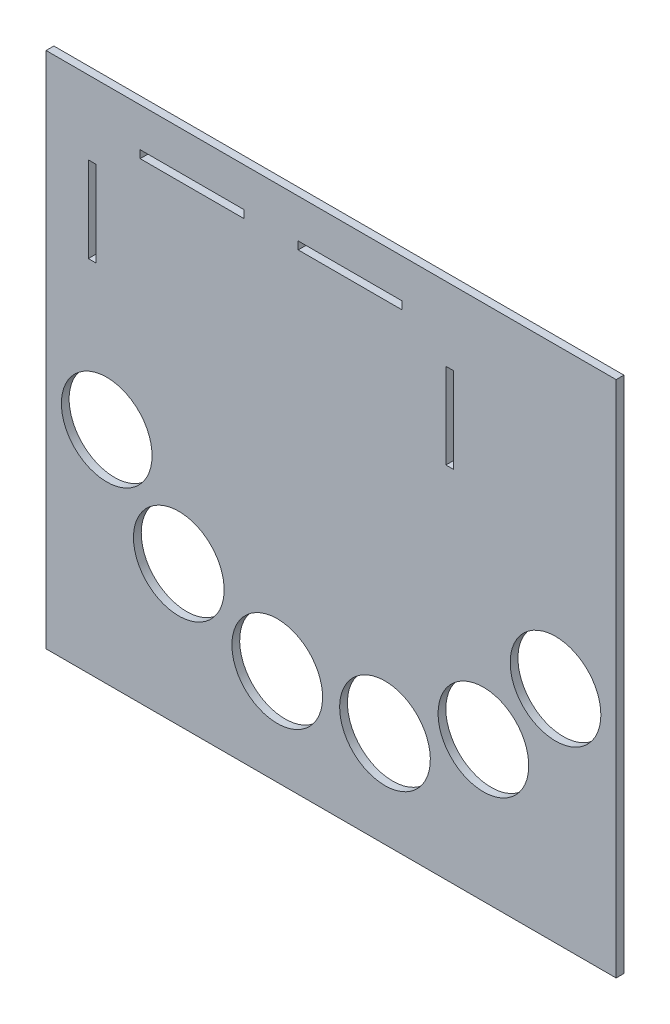
ISO-10303-21;
HEADER;
FILE_DESCRIPTION(('STEP AP214'),'2;1');
FILE_NAME('part.step','',(''),(''),'','','');
FILE_SCHEMA(('AUTOMOTIVE_DESIGN { 1 0 10303 214 1 1 1 1 }'));
ENDSEC;
DATA;
#1=APPLICATION_CONTEXT('core data for automotive mechanical design processes');
#2=APPLICATION_PROTOCOL_DEFINITION('international standard','automotive_design',2000,#1);
#3=PRODUCT_CONTEXT('',#1,'mechanical');
#4=PRODUCT('Part','Part','',(#3));
#5=PRODUCT_RELATED_PRODUCT_CATEGORY('part','',(#4));
#6=PRODUCT_DEFINITION_FORMATION('','',#4);
#7=PRODUCT_DEFINITION_CONTEXT('part definition',#1,'design');
#8=PRODUCT_DEFINITION('design','',#6,#7);
#9=PRODUCT_DEFINITION_SHAPE('','',#8);
#10=(LENGTH_UNIT() NAMED_UNIT(*) SI_UNIT(.MILLI.,.METRE.));
#11=(NAMED_UNIT(*) PLANE_ANGLE_UNIT() SI_UNIT($,.RADIAN.));
#12=(NAMED_UNIT(*) SI_UNIT($,.STERADIAN.) SOLID_ANGLE_UNIT());
#13=UNCERTAINTY_MEASURE_WITH_UNIT(LENGTH_MEASURE(1.E-05),#10,'distance_accuracy_value','');
#14=(GEOMETRIC_REPRESENTATION_CONTEXT(3) GLOBAL_UNCERTAINTY_ASSIGNED_CONTEXT((#13)) GLOBAL_UNIT_ASSIGNED_CONTEXT((#10,
#11,#12)) REPRESENTATION_CONTEXT('',''));
#15=CARTESIAN_POINT('',(0.,0.,0.));
#16=DIRECTION('',(0.,0.,1.));
#17=DIRECTION('',(1.,0.,0.));
#18=AXIS2_PLACEMENT_3D('',#15,#16,#17);
#19=CARTESIAN_POINT('',(0.,0.,0.));
#20=DIRECTION('',(0.,0.,-1.));
#21=DIRECTION('',(-1.,0.,0.));
#22=AXIS2_PLACEMENT_3D('',#19,#20,#21);
#23=PLANE('',#22);
#24=CARTESIAN_POINT('',(-58.7785252292477,-45.9016994374945,0.));
#25=DIRECTION('',(0.,0.,1.));
#26=DIRECTION('',(0.913545457642601,0.406736643075801,0.));
#27=AXIS2_PLACEMENT_3D('',#24,#25,#26);
#28=CIRCLE('',#27,17.5);
#29=CARTESIAN_POINT('',(-42.7914797205022,-38.7838081836679,0.));
#30=VERTEX_POINT('',#29);
#31=EDGE_CURVE('E309',#30,#30,#28,.T.);
#32=ORIENTED_EDGE('',*,*,#31,.T.);
#33=EDGE_LOOP('',(#32));
#34=FACE_BOUND('',#33,.T.);
#35=CARTESIAN_POINT('',(-20.7911690817763,-62.8147600733805,0.));
#36=DIRECTION('',(0.,0.,1.));
#37=DIRECTION('',(0.669130606358857,0.743144825477395,0.));
#38=AXIS2_PLACEMENT_3D('',#35,#36,#37);
#39=CIRCLE('',#38,17.5);
#40=CARTESIAN_POINT('',(-9.08138347049632,-49.8097256275261,0.));
#41=VERTEX_POINT('',#40);
#42=EDGE_CURVE('E316',#41,#41,#39,.T.);
#43=ORIENTED_EDGE('',*,*,#42,.T.);
#44=EDGE_LOOP('',(#43));
#45=FACE_BOUND('',#44,.T.);
#46=CARTESIAN_POINT('',(20.7911690817756,-62.8147600733806,0.));
#47=DIRECTION('',(0.,0.,1.));
#48=DIRECTION('',(0.309016994374945,0.951056516295154,0.));
#49=AXIS2_PLACEMENT_3D('',#46,#47,#48);
#50=CIRCLE('',#49,17.5);
#51=CARTESIAN_POINT('',(26.1989664833372,-46.1712710382154,0.));
#52=VERTEX_POINT('',#51);
#53=EDGE_CURVE('E322',#52,#52,#50,.T.);
#54=ORIENTED_EDGE('',*,*,#53,.T.);
#55=EDGE_LOOP('',(#54));
#56=FACE_BOUND('',#55,.T.);
#57=CARTESIAN_POINT('',(86.6025403784438,-15.0000000000001,0.));
#58=DIRECTION('',(0.,0.,1.));
#59=DIRECTION('',(-0.500000000000004,0.866025403784436,0.));
#60=AXIS2_PLACEMENT_3D('',#57,#58,#59);
#61=CIRCLE('',#60,17.5);
#62=CARTESIAN_POINT('',(77.8525403784437,0.155444566227538,0.));
#63=VERTEX_POINT('',#62);
#64=EDGE_CURVE('E329',#63,#63,#61,.T.);
#65=ORIENTED_EDGE('',*,*,#64,.T.);
#66=EDGE_LOOP('',(#65));
#67=FACE_BOUND('',#66,.T.);
#68=CARTESIAN_POINT('',(58.7785252292471,-45.9016994374949,0.));
#69=DIRECTION('',(0.,0.,1.));
#70=DIRECTION('',(-0.104528463267657,0.994521895368273,0.));
#71=AXIS2_PLACEMENT_3D('',#68,#69,#70);
#72=CIRCLE('',#71,17.5);
#73=CARTESIAN_POINT('',(56.9492771220631,-28.4975662685501,0.));
#74=VERTEX_POINT('',#73);
#75=EDGE_CURVE('E328',#74,#74,#72,.T.);
#76=ORIENTED_EDGE('',*,*,#75,.T.);
#77=EDGE_LOOP('',(#76));
#78=FACE_BOUND('',#77,.T.);
#79=CARTESIAN_POINT('',(-86.6025403784442,-14.9999999999995,0.));
#80=DIRECTION('',(0.,0.,1.));
#81=DIRECTION('',(1.,0.,0.));
#82=AXIS2_PLACEMENT_3D('',#79,#80,#81);
#83=CIRCLE('',#82,17.5);
#84=CARTESIAN_POINT('',(-69.1025403784441,-14.9999999999995,0.));
#85=VERTEX_POINT('',#84);
#86=EDGE_CURVE('E339',#85,#85,#83,.T.);
#87=ORIENTED_EDGE('',*,*,#86,.T.);
#88=EDGE_LOOP('',(#87));
#89=FACE_BOUND('',#88,.T.);
#90=DIRECTION('',(0.,1.,0.));
#91=VECTOR('',#90,1.);
#92=CARTESIAN_POINT('',(110.,-100.,0.));
#93=LINE('',#92,#91);
#94=CARTESIAN_POINT('',(110.,-100.,0.));
#95=VERTEX_POINT('',#94);
#96=CARTESIAN_POINT('',(110.,100.,0.));
#97=VERTEX_POINT('',#96);
#98=EDGE_CURVE('E342',#95,#97,#93,.T.);
#99=ORIENTED_EDGE('',*,*,#98,.F.);
#100=DIRECTION('',(1.,0.,0.));
#101=VECTOR('',#100,1.);
#102=CARTESIAN_POINT('',(-110.,-100.,0.));
#103=LINE('',#102,#101);
#104=CARTESIAN_POINT('',(-110.,-100.,0.));
#105=VERTEX_POINT('',#104);
#106=EDGE_CURVE('E349',#105,#95,#103,.T.);
#107=ORIENTED_EDGE('',*,*,#106,.F.);
#108=DIRECTION('',(0.,-1.,0.));
#109=VECTOR('',#108,1.);
#110=CARTESIAN_POINT('',(-110.,-100.,0.));
#111=LINE('',#110,#109);
#112=CARTESIAN_POINT('',(-110.,100.,0.));
#113=VERTEX_POINT('',#112);
#114=EDGE_CURVE('E360',#113,#105,#111,.T.);
#115=ORIENTED_EDGE('',*,*,#114,.F.);
#116=DIRECTION('',(-1.,0.,0.));
#117=VECTOR('',#116,1.);
#118=CARTESIAN_POINT('',(-110.,100.,0.));
#119=LINE('',#118,#117);
#120=EDGE_CURVE('E358',#97,#113,#119,.T.);
#121=ORIENTED_EDGE('',*,*,#120,.F.);
#122=EDGE_LOOP('',(#99,#107,#115,#121));
#123=FACE_BOUND('',#122,.T.);
#124=DIRECTION('',(0.,-1.,0.));
#125=VECTOR('',#124,1.);
#126=CARTESIAN_POINT('',(-90.7,38.6,0.));
#127=LINE('',#126,#125);
#128=CARTESIAN_POINT('',(-90.7,71.6,0.));
#129=VERTEX_POINT('',#128);
#130=CARTESIAN_POINT('',(-90.7,38.6,0.));
#131=VERTEX_POINT('',#130);
#132=EDGE_CURVE('E197',#129,#131,#127,.T.);
#133=ORIENTED_EDGE('',*,*,#132,.F.);
#134=DIRECTION('',(1.,0.,0.));
#135=VECTOR('',#134,1.);
#136=CARTESIAN_POINT('',(-93.7,71.6,0.));
#137=LINE('',#136,#135);
#138=CARTESIAN_POINT('',(-93.7,71.6,0.));
#139=VERTEX_POINT('',#138);
#140=EDGE_CURVE('E179',#139,#129,#137,.T.);
#141=ORIENTED_EDGE('',*,*,#140,.F.);
#142=DIRECTION('',(0.,1.,0.));
#143=VECTOR('',#142,1.);
#144=CARTESIAN_POINT('',(-93.7,38.6,0.));
#145=LINE('',#144,#143);
#146=CARTESIAN_POINT('',(-93.7,38.6,0.));
#147=VERTEX_POINT('',#146);
#148=EDGE_CURVE('E189',#147,#139,#145,.T.);
#149=ORIENTED_EDGE('',*,*,#148,.F.);
#150=DIRECTION('',(-1.,0.,0.));
#151=VECTOR('',#150,1.);
#152=CARTESIAN_POINT('',(-93.7,38.6,0.));
#153=LINE('',#152,#151);
#154=EDGE_CURVE('E194',#131,#147,#153,.T.);
#155=ORIENTED_EDGE('',*,*,#154,.F.);
#156=EDGE_LOOP('',(#133,#141,#149,#155));
#157=FACE_BOUND('',#156,.T.);
#158=DIRECTION('',(1.,0.,0.));
#159=VECTOR('',#158,1.);
#160=CARTESIAN_POINT('',(-12.6999999999732,85.0000000000037,0.));
#161=LINE('',#160,#159);
#162=CARTESIAN_POINT('',(-12.6999999999732,85.0000000000037,0.));
#163=VERTEX_POINT('',#162);
#164=CARTESIAN_POINT('',(27.3000000000268,85.0000000000037,0.));
#165=VERTEX_POINT('',#164);
#166=EDGE_CURVE('E224',#163,#165,#161,.T.);
#167=ORIENTED_EDGE('',*,*,#166,.F.);
#168=DIRECTION('',(0.,1.,0.));
#169=VECTOR('',#168,1.);
#170=CARTESIAN_POINT('',(-12.6999999999732,82.0000000000037,0.));
#171=LINE('',#170,#169);
#172=CARTESIAN_POINT('',(-12.6999999999732,82.0000000000037,0.));
#173=VERTEX_POINT('',#172);
#174=EDGE_CURVE('E226',#173,#163,#171,.T.);
#175=ORIENTED_EDGE('',*,*,#174,.F.);
#176=DIRECTION('',(-1.,0.,0.));
#177=VECTOR('',#176,1.);
#178=CARTESIAN_POINT('',(-12.6999999999732,82.0000000000037,0.));
#179=LINE('',#178,#177);
#180=CARTESIAN_POINT('',(27.3000000000268,82.0000000000037,0.));
#181=VERTEX_POINT('',#180);
#182=EDGE_CURVE('E229',#181,#173,#179,.T.);
#183=ORIENTED_EDGE('',*,*,#182,.F.);
#184=DIRECTION('',(0.,-1.,0.));
#185=VECTOR('',#184,1.);
#186=CARTESIAN_POINT('',(27.3000000000268,82.0000000000037,0.));
#187=LINE('',#186,#185);
#188=EDGE_CURVE('E220',#165,#181,#187,.T.);
#189=ORIENTED_EDGE('',*,*,#188,.F.);
#190=EDGE_LOOP('',(#167,#175,#183,#189));
#191=FACE_BOUND('',#190,.T.);
#192=DIRECTION('',(1.,0.,0.));
#193=VECTOR('',#192,1.);
#194=CARTESIAN_POINT('',(-73.6999999999732,85.0000000000037,0.));
#195=LINE('',#194,#193);
#196=CARTESIAN_POINT('',(-73.6999999999732,85.0000000000037,0.));
#197=VERTEX_POINT('',#196);
#198=CARTESIAN_POINT('',(-33.6999999999732,85.0000000000037,0.));
#199=VERTEX_POINT('',#198);
#200=EDGE_CURVE('E249',#197,#199,#195,.T.);
#201=ORIENTED_EDGE('',*,*,#200,.F.);
#202=DIRECTION('',(0.,1.,0.));
#203=VECTOR('',#202,1.);
#204=CARTESIAN_POINT('',(-73.6999999999732,82.0000000000037,0.));
#205=LINE('',#204,#203);
#206=CARTESIAN_POINT('',(-73.6999999999732,82.0000000000037,0.));
#207=VERTEX_POINT('',#206);
#208=EDGE_CURVE('E251',#207,#197,#205,.T.);
#209=ORIENTED_EDGE('',*,*,#208,.F.);
#210=DIRECTION('',(-1.,0.,0.));
#211=VECTOR('',#210,1.);
#212=CARTESIAN_POINT('',(-73.6999999999732,82.0000000000037,0.));
#213=LINE('',#212,#211);
#214=CARTESIAN_POINT('',(-33.6999999999732,82.0000000000037,0.));
#215=VERTEX_POINT('',#214);
#216=EDGE_CURVE('E254',#215,#207,#213,.T.);
#217=ORIENTED_EDGE('',*,*,#216,.F.);
#218=DIRECTION('',(0.,-1.,0.));
#219=VECTOR('',#218,1.);
#220=CARTESIAN_POINT('',(-33.6999999999732,82.0000000000037,0.));
#221=LINE('',#220,#219);
#222=EDGE_CURVE('E247',#199,#215,#221,.T.);
#223=ORIENTED_EDGE('',*,*,#222,.F.);
#224=EDGE_LOOP('',(#201,#209,#217,#223));
#225=FACE_BOUND('',#224,.T.);
#226=DIRECTION('',(0.,-1.,0.));
#227=VECTOR('',#226,1.);
#228=CARTESIAN_POINT('',(47.3,38.6,0.));
#229=LINE('',#228,#227);
#230=CARTESIAN_POINT('',(47.3,71.6,0.));
#231=VERTEX_POINT('',#230);
#232=CARTESIAN_POINT('',(47.3,38.6,0.));
#233=VERTEX_POINT('',#232);
#234=EDGE_CURVE('E274',#231,#233,#229,.T.);
#235=ORIENTED_EDGE('',*,*,#234,.F.);
#236=DIRECTION('',(1.,0.,0.));
#237=VECTOR('',#236,1.);
#238=CARTESIAN_POINT('',(44.3,71.6,0.));
#239=LINE('',#238,#237);
#240=CARTESIAN_POINT('',(44.3,71.6,0.));
#241=VERTEX_POINT('',#240);
#242=EDGE_CURVE('E277',#241,#231,#239,.T.);
#243=ORIENTED_EDGE('',*,*,#242,.F.);
#244=DIRECTION('',(0.,1.,0.));
#245=VECTOR('',#244,1.);
#246=CARTESIAN_POINT('',(44.3,38.6,0.));
#247=LINE('',#246,#245);
#248=CARTESIAN_POINT('',(44.3,38.6,0.));
#249=VERTEX_POINT('',#248);
#250=EDGE_CURVE('E280',#249,#241,#247,.T.);
#251=ORIENTED_EDGE('',*,*,#250,.F.);
#252=DIRECTION('',(-1.,0.,0.));
#253=VECTOR('',#252,1.);
#254=CARTESIAN_POINT('',(44.3,38.6,0.));
#255=LINE('',#254,#253);
#256=EDGE_CURVE('E267',#233,#249,#255,.T.);
#257=ORIENTED_EDGE('',*,*,#256,.F.);
#258=EDGE_LOOP('',(#235,#243,#251,#257));
#259=FACE_BOUND('',#258,.T.);
#260=ADVANCED_FACE('F37',(#34,#45,#56,#67,#78,#89,#123,#157,#191,#225,#259),#23,.T.);
#261=CARTESIAN_POINT('',(110.,-100.,3.));
#262=DIRECTION('',(-1.,0.,0.));
#263=DIRECTION('',(0.,0.,1.));
#264=AXIS2_PLACEMENT_3D('',#261,#262,#263);
#265=PLANE('',#264);
#266=ORIENTED_EDGE('',*,*,#98,.T.);
#267=DIRECTION('',(0.,0.,-1.));
#268=VECTOR('',#267,1.);
#269=CARTESIAN_POINT('',(110.,100.,3.));
#270=LINE('',#269,#268);
#271=CARTESIAN_POINT('',(110.,100.,3.));
#272=VERTEX_POINT('',#271);
#273=EDGE_CURVE('E11',#272,#97,#270,.T.);
#274=ORIENTED_EDGE('',*,*,#273,.F.);
#275=DIRECTION('',(0.,1.,0.));
#276=VECTOR('',#275,1.);
#277=CARTESIAN_POINT('',(110.,-100.,3.));
#278=LINE('',#277,#276);
#279=CARTESIAN_POINT('',(110.,-100.,3.));
#280=VERTEX_POINT('',#279);
#281=EDGE_CURVE('E345',#280,#272,#278,.T.);
#282=ORIENTED_EDGE('',*,*,#281,.F.);
#283=DIRECTION('',(0.,0.,-1.));
#284=VECTOR('',#283,1.);
#285=CARTESIAN_POINT('',(110.,-100.,3.));
#286=LINE('',#285,#284);
#287=EDGE_CURVE('E355',#280,#95,#286,.T.);
#288=ORIENTED_EDGE('',*,*,#287,.T.);
#289=EDGE_LOOP('',(#266,#274,#282,#288));
#290=FACE_BOUND('',#289,.T.);
#291=ADVANCED_FACE('F39',(#290),#265,.F.);
#292=CARTESIAN_POINT('',(-110.,100.,3.));
#293=DIRECTION('',(0.,-1.,0.));
#294=DIRECTION('',(0.,0.,-1.));
#295=AXIS2_PLACEMENT_3D('',#292,#293,#294);
#296=PLANE('',#295);
#297=ORIENTED_EDGE('',*,*,#120,.T.);
#298=DIRECTION('',(0.,0.,-1.));
#299=VECTOR('',#298,1.);
#300=CARTESIAN_POINT('',(-110.,100.,3.));
#301=LINE('',#300,#299);
#302=CARTESIAN_POINT('',(-110.,100.,3.));
#303=VERTEX_POINT('',#302);
#304=EDGE_CURVE('E45',#303,#113,#301,.T.);
#305=ORIENTED_EDGE('',*,*,#304,.F.);
#306=DIRECTION('',(-1.,0.,0.));
#307=VECTOR('',#306,1.);
#308=CARTESIAN_POINT('',(-110.,100.,3.));
#309=LINE('',#308,#307);
#310=EDGE_CURVE('E348',#272,#303,#309,.T.);
#311=ORIENTED_EDGE('',*,*,#310,.F.);
#312=ORIENTED_EDGE('',*,*,#273,.T.);
#313=EDGE_LOOP('',(#297,#305,#311,#312));
#314=FACE_BOUND('',#313,.T.);
#315=ADVANCED_FACE('F387',(#314),#296,.F.);
#316=CARTESIAN_POINT('',(-110.,-100.,3.));
#317=DIRECTION('',(1.,0.,0.));
#318=DIRECTION('',(0.,0.,-1.));
#319=AXIS2_PLACEMENT_3D('',#316,#317,#318);
#320=PLANE('',#319);
#321=ORIENTED_EDGE('',*,*,#114,.T.);
#322=DIRECTION('',(0.,0.,-1.));
#323=VECTOR('',#322,1.);
#324=CARTESIAN_POINT('',(-110.,-100.,3.));
#325=LINE('',#324,#323);
#326=CARTESIAN_POINT('',(-110.,-100.,3.));
#327=VERTEX_POINT('',#326);
#328=EDGE_CURVE('E365',#327,#105,#325,.T.);
#329=ORIENTED_EDGE('',*,*,#328,.F.);
#330=DIRECTION('',(0.,-1.,0.));
#331=VECTOR('',#330,1.);
#332=CARTESIAN_POINT('',(-110.,-100.,3.));
#333=LINE('',#332,#331);
#334=EDGE_CURVE('E351',#303,#327,#333,.T.);
#335=ORIENTED_EDGE('',*,*,#334,.F.);
#336=ORIENTED_EDGE('',*,*,#304,.T.);
#337=EDGE_LOOP('',(#321,#329,#335,#336));
#338=FACE_BOUND('',#337,.T.);
#339=ADVANCED_FACE('F372',(#338),#320,.F.);
#340=CARTESIAN_POINT('',(-110.,-100.,3.));
#341=DIRECTION('',(0.,1.,0.));
#342=DIRECTION('',(0.,0.,1.));
#343=AXIS2_PLACEMENT_3D('',#340,#341,#342);
#344=PLANE('',#343);
#345=ORIENTED_EDGE('',*,*,#106,.T.);
#346=ORIENTED_EDGE('',*,*,#287,.F.);
#347=DIRECTION('',(1.,0.,0.));
#348=VECTOR('',#347,1.);
#349=CARTESIAN_POINT('',(-110.,-100.,3.));
#350=LINE('',#349,#348);
#351=EDGE_CURVE('E353',#327,#280,#350,.T.);
#352=ORIENTED_EDGE('',*,*,#351,.F.);
#353=ORIENTED_EDGE('',*,*,#328,.T.);
#354=EDGE_LOOP('',(#345,#346,#352,#353));
#355=FACE_BOUND('',#354,.T.);
#356=ADVANCED_FACE('F380',(#355),#344,.F.);
#357=CARTESIAN_POINT('',(0.,0.,3.));
#358=DIRECTION('',(0.,0.,-1.));
#359=DIRECTION('',(-1.,0.,0.));
#360=AXIS2_PLACEMENT_3D('',#357,#358,#359);
#361=PLANE('',#360);
#362=DIRECTION('',(-1.,0.,0.));
#363=VECTOR('',#362,1.);
#364=CARTESIAN_POINT('',(44.3,38.6,3.));
#365=LINE('',#364,#363);
#366=CARTESIAN_POINT('',(47.3,38.6,3.));
#367=VERTEX_POINT('',#366);
#368=CARTESIAN_POINT('',(44.3,38.6,3.));
#369=VERTEX_POINT('',#368);
#370=EDGE_CURVE('E264',#367,#369,#365,.T.);
#371=ORIENTED_EDGE('',*,*,#370,.T.);
#372=DIRECTION('',(0.,1.,0.));
#373=VECTOR('',#372,1.);
#374=CARTESIAN_POINT('',(44.3,0.,3.));
#375=LINE('',#374,#373);
#376=CARTESIAN_POINT('',(44.3,71.6,3.));
#377=VERTEX_POINT('',#376);
#378=EDGE_CURVE('E305',#369,#377,#375,.T.);
#379=ORIENTED_EDGE('',*,*,#378,.T.);
#380=DIRECTION('',(1.,0.,0.));
#381=VECTOR('',#380,1.);
#382=CARTESIAN_POINT('',(44.3,71.6,3.));
#383=LINE('',#382,#381);
#384=CARTESIAN_POINT('',(47.3,71.6,3.));
#385=VERTEX_POINT('',#384);
#386=EDGE_CURVE('E269',#377,#385,#383,.T.);
#387=ORIENTED_EDGE('',*,*,#386,.T.);
#388=DIRECTION('',(0.,1.,0.));
#389=VECTOR('',#388,1.);
#390=CARTESIAN_POINT('',(47.3,0.,3.));
#391=LINE('',#390,#389);
#392=EDGE_CURVE('E303',#367,#385,#391,.T.);
#393=ORIENTED_EDGE('',*,*,#392,.F.);
#394=EDGE_LOOP('',(#371,#379,#387,#393));
#395=FACE_BOUND('',#394,.T.);
#396=DIRECTION('',(0.,1.,0.));
#397=VECTOR('',#396,1.);
#398=CARTESIAN_POINT('',(-73.6999999999732,82.0000000000037,3.00000000000797));
#399=LINE('',#398,#397);
#400=CARTESIAN_POINT('',(-73.6999999999732,82.0000000000037,3.00000000000797));
#401=VERTEX_POINT('',#400);
#402=CARTESIAN_POINT('',(-73.6999999999732,85.0000000000037,3.00000000000797));
#403=VERTEX_POINT('',#402);
#404=EDGE_CURVE('E243',#401,#403,#399,.T.);
#405=ORIENTED_EDGE('',*,*,#404,.T.);
#406=DIRECTION('',(1.,0.,0.));
#407=VECTOR('',#406,1.);
#408=CARTESIAN_POINT('',(0.,85.0000000000037,3.));
#409=LINE('',#408,#407);
#410=CARTESIAN_POINT('',(-33.6999999999732,85.0000000000037,3.00000000000797));
#411=VERTEX_POINT('',#410);
#412=EDGE_CURVE('E302',#403,#411,#409,.T.);
#413=ORIENTED_EDGE('',*,*,#412,.T.);
#414=DIRECTION('',(0.,-1.,0.));
#415=VECTOR('',#414,1.);
#416=CARTESIAN_POINT('',(-33.6999999999732,82.0000000000037,3.00000000000797));
#417=LINE('',#416,#415);
#418=CARTESIAN_POINT('',(-33.6999999999732,82.0000000000037,3.));
#419=VERTEX_POINT('',#418);
#420=EDGE_CURVE('E239',#411,#419,#417,.T.);
#421=ORIENTED_EDGE('',*,*,#420,.T.);
#422=DIRECTION('',(1.,0.,0.));
#423=VECTOR('',#422,1.);
#424=CARTESIAN_POINT('',(0.,82.0000000000037,3.));
#425=LINE('',#424,#423);
#426=EDGE_CURVE('E298',#401,#419,#425,.T.);
#427=ORIENTED_EDGE('',*,*,#426,.F.);
#428=EDGE_LOOP('',(#405,#413,#421,#427));
#429=FACE_BOUND('',#428,.T.);
#430=DIRECTION('',(0.,1.,0.));
#431=VECTOR('',#430,1.);
#432=CARTESIAN_POINT('',(-12.6999999999732,82.0000000000037,3.00000000000797));
#433=LINE('',#432,#431);
#434=CARTESIAN_POINT('',(-12.6999999999732,82.0000000000037,3.00000000000797));
#435=VERTEX_POINT('',#434);
#436=CARTESIAN_POINT('',(-12.6999999999732,85.0000000000037,3.00000000000797));
#437=VERTEX_POINT('',#436);
#438=EDGE_CURVE('E216',#435,#437,#433,.T.);
#439=ORIENTED_EDGE('',*,*,#438,.T.);
#440=CARTESIAN_POINT('',(27.3000000000268,85.0000000000037,3.00000000000797));
#441=VERTEX_POINT('',#440);
#442=EDGE_CURVE('E299',#437,#441,#409,.T.);
#443=ORIENTED_EDGE('',*,*,#442,.T.);
#444=DIRECTION('',(0.,-1.,0.));
#445=VECTOR('',#444,1.);
#446=CARTESIAN_POINT('',(27.3000000000268,82.0000000000037,3.00000000000797));
#447=LINE('',#446,#445);
#448=CARTESIAN_POINT('',(27.3000000000268,82.0000000000037,3.));
#449=VERTEX_POINT('',#448);
#450=EDGE_CURVE('E211',#441,#449,#447,.T.);
#451=ORIENTED_EDGE('',*,*,#450,.T.);
#452=EDGE_CURVE('E295',#435,#449,#425,.T.);
#453=ORIENTED_EDGE('',*,*,#452,.F.);
#454=EDGE_LOOP('',(#439,#443,#451,#453));
#455=FACE_BOUND('',#454,.T.);
#456=DIRECTION('',(0.,-1.,0.));
#457=VECTOR('',#456,1.);
#458=CARTESIAN_POINT('',(-93.6999999999732,0.,3.));
#459=LINE('',#458,#457);
#460=CARTESIAN_POINT('',(-93.7,71.6,3.));
#461=VERTEX_POINT('',#460);
#462=CARTESIAN_POINT('',(-93.7,38.6,3.));
#463=VERTEX_POINT('',#462);
#464=EDGE_CURVE('E293',#461,#463,#459,.T.);
#465=ORIENTED_EDGE('',*,*,#464,.F.);
#466=DIRECTION('',(1.,0.,0.));
#467=VECTOR('',#466,1.);
#468=CARTESIAN_POINT('',(-93.7,71.6,3.));
#469=LINE('',#468,#467);
#470=CARTESIAN_POINT('',(-90.7,71.6,3.));
#471=VERTEX_POINT('',#470);
#472=EDGE_CURVE('E182',#461,#471,#469,.T.);
#473=ORIENTED_EDGE('',*,*,#472,.T.);
#474=DIRECTION('',(0.,-1.,0.));
#475=VECTOR('',#474,1.);
#476=CARTESIAN_POINT('',(-90.7,0.,3.));
#477=LINE('',#476,#475);
#478=CARTESIAN_POINT('',(-90.7,38.6,3.));
#479=VERTEX_POINT('',#478);
#480=EDGE_CURVE('E276',#471,#479,#477,.T.);
#481=ORIENTED_EDGE('',*,*,#480,.T.);
#482=DIRECTION('',(-1.,0.,0.));
#483=VECTOR('',#482,1.);
#484=CARTESIAN_POINT('',(-93.7,38.6,3.));
#485=LINE('',#484,#483);
#486=EDGE_CURVE('E203',#479,#463,#485,.T.);
#487=ORIENTED_EDGE('',*,*,#486,.T.);
#488=EDGE_LOOP('',(#465,#473,#481,#487));
#489=FACE_BOUND('',#488,.T.);
#490=CARTESIAN_POINT('',(-58.7785252292477,-45.9016994374945,3.));
#491=DIRECTION('',(0.,0.,1.));
#492=DIRECTION('',(0.913545457642601,0.406736643075801,0.));
#493=AXIS2_PLACEMENT_3D('',#490,#491,#492);
#494=CIRCLE('',#493,17.5);
#495=CARTESIAN_POINT('',(-42.7914797205022,-38.7838081836679,3.));
#496=VERTEX_POINT('',#495);
#497=EDGE_CURVE('E313',#496,#496,#494,.T.);
#498=ORIENTED_EDGE('',*,*,#497,.F.);
#499=EDGE_LOOP('',(#498));
#500=FACE_BOUND('',#499,.T.);
#501=CARTESIAN_POINT('',(-20.7911690817763,-62.8147600733805,3.));
#502=DIRECTION('',(0.,0.,1.));
#503=DIRECTION('',(0.669130606358857,0.743144825477395,0.));
#504=AXIS2_PLACEMENT_3D('',#501,#502,#503);
#505=CIRCLE('',#504,17.5);
#506=CARTESIAN_POINT('',(-9.08138347049632,-49.8097256275261,3.));
#507=VERTEX_POINT('',#506);
#508=EDGE_CURVE('E319',#507,#507,#505,.T.);
#509=ORIENTED_EDGE('',*,*,#508,.F.);
#510=EDGE_LOOP('',(#509));
#511=FACE_BOUND('',#510,.T.);
#512=CARTESIAN_POINT('',(20.7911690817756,-62.8147600733806,3.));
#513=DIRECTION('',(0.,0.,1.));
#514=DIRECTION('',(0.309016994374945,0.951056516295154,0.));
#515=AXIS2_PLACEMENT_3D('',#512,#513,#514);
#516=CIRCLE('',#515,17.5);
#517=CARTESIAN_POINT('',(26.1989664833372,-46.1712710382154,3.));
#518=VERTEX_POINT('',#517);
#519=EDGE_CURVE('E325',#518,#518,#516,.T.);
#520=ORIENTED_EDGE('',*,*,#519,.F.);
#521=EDGE_LOOP('',(#520));
#522=FACE_BOUND('',#521,.T.);
#523=CARTESIAN_POINT('',(86.6025403784438,-15.0000000000001,3.));
#524=DIRECTION('',(0.,0.,1.));
#525=DIRECTION('',(-0.500000000000004,0.866025403784436,0.));
#526=AXIS2_PLACEMENT_3D('',#523,#524,#525);
#527=CIRCLE('',#526,17.5);
#528=CARTESIAN_POINT('',(77.8525403784437,0.155444566227538,3.));
#529=VERTEX_POINT('',#528);
#530=EDGE_CURVE('E308',#529,#529,#527,.T.);
#531=ORIENTED_EDGE('',*,*,#530,.F.);
#532=EDGE_LOOP('',(#531));
#533=FACE_BOUND('',#532,.T.);
#534=CARTESIAN_POINT('',(58.7785252292471,-45.9016994374949,3.));
#535=DIRECTION('',(0.,0.,1.));
#536=DIRECTION('',(-0.104528463267657,0.994521895368273,0.));
#537=AXIS2_PLACEMENT_3D('',#534,#535,#536);
#538=CIRCLE('',#537,17.5);
#539=CARTESIAN_POINT('',(56.9492771220631,-28.4975662685501,3.));
#540=VERTEX_POINT('',#539);
#541=EDGE_CURVE('E332',#540,#540,#538,.T.);
#542=ORIENTED_EDGE('',*,*,#541,.F.);
#543=EDGE_LOOP('',(#542));
#544=FACE_BOUND('',#543,.T.);
#545=CARTESIAN_POINT('',(-86.6025403784442,-14.9999999999995,3.));
#546=DIRECTION('',(0.,0.,1.));
#547=DIRECTION('',(1.,0.,0.));
#548=AXIS2_PLACEMENT_3D('',#545,#546,#547);
#549=CIRCLE('',#548,17.5);
#550=CARTESIAN_POINT('',(-69.1025403784441,-14.9999999999995,3.));
#551=VERTEX_POINT('',#550);
#552=EDGE_CURVE('E312',#551,#551,#549,.T.);
#553=ORIENTED_EDGE('',*,*,#552,.F.);
#554=EDGE_LOOP('',(#553));
#555=FACE_BOUND('',#554,.T.);
#556=ORIENTED_EDGE('',*,*,#281,.T.);
#557=ORIENTED_EDGE('',*,*,#310,.T.);
#558=ORIENTED_EDGE('',*,*,#334,.T.);
#559=ORIENTED_EDGE('',*,*,#351,.T.);
#560=EDGE_LOOP('',(#556,#557,#558,#559));
#561=FACE_BOUND('',#560,.T.);
#562=ADVANCED_FACE('F386',(#395,#429,#455,#489,#500,#511,#522,#533,#544,#555,#561),#361,.F.);
#563=CARTESIAN_POINT('',(-86.6025403784442,-14.9999999999995,0.));
#564=DIRECTION('',(0.,0.,1.));
#565=DIRECTION('',(1.,0.,0.));
#566=AXIS2_PLACEMENT_3D('',#563,#564,#565);
#567=CYLINDRICAL_SURFACE('',#566,17.5);
#568=ORIENTED_EDGE('',*,*,#86,.F.);
#569=EDGE_LOOP('',(#568));
#570=FACE_BOUND('',#569,.T.);
#571=ORIENTED_EDGE('',*,*,#552,.T.);
#572=EDGE_LOOP('',(#571));
#573=FACE_BOUND('',#572,.T.);
#574=ADVANCED_FACE('F407',(#570,#573),#567,.F.);
#575=CARTESIAN_POINT('',(58.7785252292471,-45.9016994374949,0.));
#576=DIRECTION('',(0.,0.,1.));
#577=DIRECTION('',(1.,0.,0.));
#578=AXIS2_PLACEMENT_3D('',#575,#576,#577);
#579=CYLINDRICAL_SURFACE('',#578,17.5);
#580=ORIENTED_EDGE('',*,*,#75,.F.);
#581=EDGE_LOOP('',(#580));
#582=FACE_BOUND('',#581,.T.);
#583=ORIENTED_EDGE('',*,*,#541,.T.);
#584=EDGE_LOOP('',(#583));
#585=FACE_BOUND('',#584,.T.);
#586=ADVANCED_FACE('F412',(#582,#585),#579,.F.);
#587=CARTESIAN_POINT('',(86.6025403784438,-15.0000000000001,0.));
#588=DIRECTION('',(0.,0.,1.));
#589=DIRECTION('',(1.,0.,0.));
#590=AXIS2_PLACEMENT_3D('',#587,#588,#589);
#591=CYLINDRICAL_SURFACE('',#590,17.5);
#592=ORIENTED_EDGE('',*,*,#64,.F.);
#593=EDGE_LOOP('',(#592));
#594=FACE_BOUND('',#593,.T.);
#595=ORIENTED_EDGE('',*,*,#530,.T.);
#596=EDGE_LOOP('',(#595));
#597=FACE_BOUND('',#596,.T.);
#598=ADVANCED_FACE('F437',(#594,#597),#591,.F.);
#599=CARTESIAN_POINT('',(20.7911690817756,-62.8147600733806,0.));
#600=DIRECTION('',(0.,0.,1.));
#601=DIRECTION('',(1.,0.,0.));
#602=AXIS2_PLACEMENT_3D('',#599,#600,#601);
#603=CYLINDRICAL_SURFACE('',#602,17.5);
#604=ORIENTED_EDGE('',*,*,#53,.F.);
#605=EDGE_LOOP('',(#604));
#606=FACE_BOUND('',#605,.T.);
#607=ORIENTED_EDGE('',*,*,#519,.T.);
#608=EDGE_LOOP('',(#607));
#609=FACE_BOUND('',#608,.T.);
#610=ADVANCED_FACE('F443',(#606,#609),#603,.F.);
#611=CARTESIAN_POINT('',(-20.7911690817763,-62.8147600733805,0.));
#612=DIRECTION('',(0.,0.,1.));
#613=DIRECTION('',(1.,0.,0.));
#614=AXIS2_PLACEMENT_3D('',#611,#612,#613);
#615=CYLINDRICAL_SURFACE('',#614,17.5);
#616=ORIENTED_EDGE('',*,*,#42,.F.);
#617=EDGE_LOOP('',(#616));
#618=FACE_BOUND('',#617,.T.);
#619=ORIENTED_EDGE('',*,*,#508,.T.);
#620=EDGE_LOOP('',(#619));
#621=FACE_BOUND('',#620,.T.);
#622=ADVANCED_FACE('F450',(#618,#621),#615,.F.);
#623=CARTESIAN_POINT('',(-58.7785252292477,-45.9016994374945,0.));
#624=DIRECTION('',(0.,0.,1.));
#625=DIRECTION('',(1.,0.,0.));
#626=AXIS2_PLACEMENT_3D('',#623,#624,#625);
#627=CYLINDRICAL_SURFACE('',#626,17.5);
#628=ORIENTED_EDGE('',*,*,#31,.F.);
#629=EDGE_LOOP('',(#628));
#630=FACE_BOUND('',#629,.T.);
#631=ORIENTED_EDGE('',*,*,#497,.T.);
#632=EDGE_LOOP('',(#631));
#633=FACE_BOUND('',#632,.T.);
#634=ADVANCED_FACE('F454',(#630,#633),#627,.F.);
#635=CARTESIAN_POINT('',(-93.7,38.6,-33.1360830515618));
#636=DIRECTION('',(0.,1.,0.));
#637=DIRECTION('',(-1.,0.,0.));
#638=AXIS2_PLACEMENT_3D('',#635,#636,#637);
#639=PLANE('',#638);
#640=ORIENTED_EDGE('',*,*,#154,.T.);
#641=DIRECTION('',(0.,0.,1.));
#642=VECTOR('',#641,1.);
#643=CARTESIAN_POINT('',(-93.7,38.6,-33.1360830515618));
#644=LINE('',#643,#642);
#645=EDGE_CURVE('E186',#147,#463,#644,.T.);
#646=ORIENTED_EDGE('',*,*,#645,.T.);
#647=ORIENTED_EDGE('',*,*,#486,.F.);
#648=DIRECTION('',(0.,0.,1.));
#649=VECTOR('',#648,1.);
#650=CARTESIAN_POINT('',(-90.7,38.6,-33.1360830515618));
#651=LINE('',#650,#649);
#652=EDGE_CURVE('E207',#131,#479,#651,.T.);
#653=ORIENTED_EDGE('',*,*,#652,.F.);
#654=EDGE_LOOP('',(#640,#646,#647,#653));
#655=FACE_BOUND('',#654,.T.);
#656=ADVANCED_FACE('F458',(#655),#639,.T.);
#657=CARTESIAN_POINT('',(-93.7,71.6,-33.1360830515618));
#658=DIRECTION('',(0.,-1.,0.));
#659=DIRECTION('',(1.,0.,0.));
#660=AXIS2_PLACEMENT_3D('',#657,#658,#659);
#661=PLANE('',#660);
#662=ORIENTED_EDGE('',*,*,#140,.T.);
#663=DIRECTION('',(0.,0.,1.));
#664=VECTOR('',#663,1.);
#665=CARTESIAN_POINT('',(-90.7,71.6,-33.1360830515618));
#666=LINE('',#665,#664);
#667=EDGE_CURVE('E205',#129,#471,#666,.T.);
#668=ORIENTED_EDGE('',*,*,#667,.T.);
#669=ORIENTED_EDGE('',*,*,#472,.F.);
#670=DIRECTION('',(0.,0.,1.));
#671=VECTOR('',#670,1.);
#672=CARTESIAN_POINT('',(-93.7,71.6,-33.1360830515618));
#673=LINE('',#672,#671);
#674=EDGE_CURVE('E174',#139,#461,#673,.T.);
#675=ORIENTED_EDGE('',*,*,#674,.F.);
#676=EDGE_LOOP('',(#662,#668,#669,#675));
#677=FACE_BOUND('',#676,.T.);
#678=ADVANCED_FACE('F176',(#677),#661,.T.);
#679=CARTESIAN_POINT('',(-90.7,100.135528326875,176.5));
#680=DIRECTION('',(1.,0.,0.));
#681=DIRECTION('',(0.,0.,-1.));
#682=AXIS2_PLACEMENT_3D('',#679,#680,#681);
#683=PLANE('',#682);
#684=ORIENTED_EDGE('',*,*,#667,.F.);
#685=ORIENTED_EDGE('',*,*,#132,.T.);
#686=ORIENTED_EDGE('',*,*,#652,.T.);
#687=ORIENTED_EDGE('',*,*,#480,.F.);
#688=EDGE_LOOP('',(#684,#685,#686,#687));
#689=FACE_BOUND('',#688,.T.);
#690=ADVANCED_FACE('F484',(#689),#683,.F.);
#691=CARTESIAN_POINT('',(-93.6999999999732,85.0000000000037,176.500000000008));
#692=DIRECTION('',(1.,0.,0.));
#693=DIRECTION('',(0.,0.,-1.));
#694=AXIS2_PLACEMENT_3D('',#691,#692,#693);
#695=PLANE('',#694);
#696=ORIENTED_EDGE('',*,*,#464,.T.);
#697=ORIENTED_EDGE('',*,*,#645,.F.);
#698=ORIENTED_EDGE('',*,*,#148,.T.);
#699=ORIENTED_EDGE('',*,*,#674,.T.);
#700=EDGE_LOOP('',(#696,#697,#698,#699));
#701=FACE_BOUND('',#700,.T.);
#702=ADVANCED_FACE('F190',(#701),#695,.T.);
#703=CARTESIAN_POINT('',(27.3000000000268,82.0000000000037,-40.1123422402632));
#704=DIRECTION('',(-1.,0.,0.));
#705=DIRECTION('',(0.,-1.,0.));
#706=AXIS2_PLACEMENT_3D('',#703,#704,#705);
#707=PLANE('',#706);
#708=ORIENTED_EDGE('',*,*,#188,.T.);
#709=DIRECTION('',(0.,0.,1.));
#710=VECTOR('',#709,1.);
#711=CARTESIAN_POINT('',(27.3000000000268,82.0000000000037,-40.1123422402632));
#712=LINE('',#711,#710);
#713=EDGE_CURVE('E214',#181,#449,#712,.T.);
#714=ORIENTED_EDGE('',*,*,#713,.T.);
#715=ORIENTED_EDGE('',*,*,#450,.F.);
#716=DIRECTION('',(0.,0.,1.));
#717=VECTOR('',#716,1.);
#718=CARTESIAN_POINT('',(27.3000000000268,85.0000000000037,-40.1123422402632));
#719=LINE('',#718,#717);
#720=EDGE_CURVE('E215',#165,#441,#719,.T.);
#721=ORIENTED_EDGE('',*,*,#720,.F.);
#722=EDGE_LOOP('',(#708,#714,#715,#721));
#723=FACE_BOUND('',#722,.T.);
#724=ADVANCED_FACE('F483',(#723),#707,.T.);
#725=CARTESIAN_POINT('',(-12.6999999999732,82.0000000000037,-40.1123422402632));
#726=DIRECTION('',(1.,0.,0.));
#727=DIRECTION('',(0.,1.,0.));
#728=AXIS2_PLACEMENT_3D('',#725,#726,#727);
#729=PLANE('',#728);
#730=ORIENTED_EDGE('',*,*,#174,.T.);
#731=DIRECTION('',(0.,0.,1.));
#732=VECTOR('',#731,1.);
#733=CARTESIAN_POINT('',(-12.6999999999732,85.0000000000037,-40.1123422402632));
#734=LINE('',#733,#732);
#735=EDGE_CURVE('E219',#163,#437,#734,.T.);
#736=ORIENTED_EDGE('',*,*,#735,.T.);
#737=ORIENTED_EDGE('',*,*,#438,.F.);
#738=DIRECTION('',(0.,0.,1.));
#739=VECTOR('',#738,1.);
#740=CARTESIAN_POINT('',(-12.6999999999732,82.0000000000037,-40.1123422402632));
#741=LINE('',#740,#739);
#742=EDGE_CURVE('E199',#173,#435,#741,.T.);
#743=ORIENTED_EDGE('',*,*,#742,.F.);
#744=EDGE_LOOP('',(#730,#736,#737,#743));
#745=FACE_BOUND('',#744,.T.);
#746=ADVANCED_FACE('F496',(#745),#729,.T.);
#747=CARTESIAN_POINT('',(-64.2625925660206,82.0000000000037,176.500000000008));
#748=DIRECTION('',(0.,1.,0.));
#749=DIRECTION('',(-1.,0.,0.));
#750=AXIS2_PLACEMENT_3D('',#747,#748,#749);
#751=PLANE('',#750);
#752=ORIENTED_EDGE('',*,*,#452,.T.);
#753=ORIENTED_EDGE('',*,*,#713,.F.);
#754=ORIENTED_EDGE('',*,*,#182,.T.);
#755=ORIENTED_EDGE('',*,*,#742,.T.);
#756=EDGE_LOOP('',(#752,#753,#754,#755));
#757=FACE_BOUND('',#756,.T.);
#758=ADVANCED_FACE('F489',(#757),#751,.T.);
#759=CARTESIAN_POINT('',(-64.2625925660206,85.0000000000037,176.500000000008));
#760=DIRECTION('',(0.,1.,0.));
#761=DIRECTION('',(-1.,0.,0.));
#762=AXIS2_PLACEMENT_3D('',#759,#760,#761);
#763=PLANE('',#762);
#764=ORIENTED_EDGE('',*,*,#735,.F.);
#765=ORIENTED_EDGE('',*,*,#166,.T.);
#766=ORIENTED_EDGE('',*,*,#720,.T.);
#767=ORIENTED_EDGE('',*,*,#442,.F.);
#768=EDGE_LOOP('',(#764,#765,#766,#767));
#769=FACE_BOUND('',#768,.T.);
#770=ADVANCED_FACE('F474',(#769),#763,.F.);
#771=CARTESIAN_POINT('',(-33.6999999999732,82.0000000000037,-40.1123422402632));
#772=DIRECTION('',(-1.,0.,0.));
#773=DIRECTION('',(0.,-1.,0.));
#774=AXIS2_PLACEMENT_3D('',#771,#772,#773);
#775=PLANE('',#774);
#776=ORIENTED_EDGE('',*,*,#222,.T.);
#777=DIRECTION('',(0.,0.,1.));
#778=VECTOR('',#777,1.);
#779=CARTESIAN_POINT('',(-33.6999999999732,82.0000000000037,-40.1123422402632));
#780=LINE('',#779,#778);
#781=EDGE_CURVE('E60',#215,#419,#780,.T.);
#782=ORIENTED_EDGE('',*,*,#781,.T.);
#783=ORIENTED_EDGE('',*,*,#420,.F.);
#784=DIRECTION('',(0.,0.,1.));
#785=VECTOR('',#784,1.);
#786=CARTESIAN_POINT('',(-33.6999999999732,85.0000000000037,-40.1123422402632));
#787=LINE('',#786,#785);
#788=EDGE_CURVE('E242',#199,#411,#787,.T.);
#789=ORIENTED_EDGE('',*,*,#788,.F.);
#790=EDGE_LOOP('',(#776,#782,#783,#789));
#791=FACE_BOUND('',#790,.T.);
#792=ADVANCED_FACE('F492',(#791),#775,.T.);
#793=CARTESIAN_POINT('',(-73.6999999999732,82.0000000000037,-40.1123422402632));
#794=DIRECTION('',(1.,0.,0.));
#795=DIRECTION('',(0.,1.,0.));
#796=AXIS2_PLACEMENT_3D('',#793,#794,#795);
#797=PLANE('',#796);
#798=ORIENTED_EDGE('',*,*,#208,.T.);
#799=DIRECTION('',(0.,0.,1.));
#800=VECTOR('',#799,1.);
#801=CARTESIAN_POINT('',(-73.6999999999732,85.0000000000037,-40.1123422402632));
#802=LINE('',#801,#800);
#803=EDGE_CURVE('E246',#197,#403,#802,.T.);
#804=ORIENTED_EDGE('',*,*,#803,.T.);
#805=ORIENTED_EDGE('',*,*,#404,.F.);
#806=DIRECTION('',(0.,0.,1.));
#807=VECTOR('',#806,1.);
#808=CARTESIAN_POINT('',(-73.6999999999732,82.0000000000037,-40.1123422402632));
#809=LINE('',#808,#807);
#810=EDGE_CURVE('E223',#207,#401,#809,.T.);
#811=ORIENTED_EDGE('',*,*,#810,.F.);
#812=EDGE_LOOP('',(#798,#804,#805,#811));
#813=FACE_BOUND('',#812,.T.);
#814=ADVANCED_FACE('F487',(#813),#797,.T.);
#815=ORIENTED_EDGE('',*,*,#426,.T.);
#816=ORIENTED_EDGE('',*,*,#781,.F.);
#817=ORIENTED_EDGE('',*,*,#216,.T.);
#818=ORIENTED_EDGE('',*,*,#810,.T.);
#819=EDGE_LOOP('',(#815,#816,#817,#818));
#820=FACE_BOUND('',#819,.T.);
#821=ADVANCED_FACE('F472',(#820),#751,.T.);
#822=ORIENTED_EDGE('',*,*,#803,.F.);
#823=ORIENTED_EDGE('',*,*,#200,.T.);
#824=ORIENTED_EDGE('',*,*,#788,.T.);
#825=ORIENTED_EDGE('',*,*,#412,.F.);
#826=EDGE_LOOP('',(#822,#823,#824,#825));
#827=FACE_BOUND('',#826,.T.);
#828=ADVANCED_FACE('F464',(#827),#763,.F.);
#829=CARTESIAN_POINT('',(44.3,100.135528326875,176.5));
#830=DIRECTION('',(-1.,0.,0.));
#831=DIRECTION('',(0.,0.,1.));
#832=AXIS2_PLACEMENT_3D('',#829,#830,#831);
#833=PLANE('',#832);
#834=DIRECTION('',(0.,0.,1.));
#835=VECTOR('',#834,1.);
#836=CARTESIAN_POINT('',(44.3,38.6,-33.1360830515618));
#837=LINE('',#836,#835);
#838=EDGE_CURVE('E52',#249,#369,#837,.T.);
#839=ORIENTED_EDGE('',*,*,#838,.F.);
#840=ORIENTED_EDGE('',*,*,#250,.T.);
#841=DIRECTION('',(0.,0.,1.));
#842=VECTOR('',#841,1.);
#843=CARTESIAN_POINT('',(44.3,71.6,-33.1360830515618));
#844=LINE('',#843,#842);
#845=EDGE_CURVE('E273',#241,#377,#844,.T.);
#846=ORIENTED_EDGE('',*,*,#845,.T.);
#847=ORIENTED_EDGE('',*,*,#378,.F.);
#848=EDGE_LOOP('',(#839,#840,#846,#847));
#849=FACE_BOUND('',#848,.T.);
#850=ADVANCED_FACE('F460',(#849),#833,.F.);
#851=CARTESIAN_POINT('',(47.3,100.135528326875,176.5));
#852=DIRECTION('',(-1.,0.,0.));
#853=DIRECTION('',(0.,0.,1.));
#854=AXIS2_PLACEMENT_3D('',#851,#852,#853);
#855=PLANE('',#854);
#856=ORIENTED_EDGE('',*,*,#392,.T.);
#857=DIRECTION('',(0.,0.,1.));
#858=VECTOR('',#857,1.);
#859=CARTESIAN_POINT('',(47.3,71.6,-33.1360830515618));
#860=LINE('',#859,#858);
#861=EDGE_CURVE('E272',#231,#385,#860,.T.);
#862=ORIENTED_EDGE('',*,*,#861,.F.);
#863=ORIENTED_EDGE('',*,*,#234,.T.);
#864=DIRECTION('',(0.,0.,1.));
#865=VECTOR('',#864,1.);
#866=CARTESIAN_POINT('',(47.3,38.6,-33.1360830515618));
#867=LINE('',#866,#865);
#868=EDGE_CURVE('E268',#233,#367,#867,.T.);
#869=ORIENTED_EDGE('',*,*,#868,.T.);
#870=EDGE_LOOP('',(#856,#862,#863,#869));
#871=FACE_BOUND('',#870,.T.);
#872=ADVANCED_FACE('F463',(#871),#855,.T.);
#873=CARTESIAN_POINT('',(44.3,71.6,-33.1360830515618));
#874=DIRECTION('',(0.,-1.,0.));
#875=DIRECTION('',(-1.,0.,0.));
#876=AXIS2_PLACEMENT_3D('',#873,#874,#875);
#877=PLANE('',#876);
#878=ORIENTED_EDGE('',*,*,#242,.T.);
#879=ORIENTED_EDGE('',*,*,#861,.T.);
#880=ORIENTED_EDGE('',*,*,#386,.F.);
#881=ORIENTED_EDGE('',*,*,#845,.F.);
#882=EDGE_LOOP('',(#878,#879,#880,#881));
#883=FACE_BOUND('',#882,.T.);
#884=ADVANCED_FACE('F468',(#883),#877,.T.);
#885=CARTESIAN_POINT('',(44.3,38.6,-33.1360830515618));
#886=DIRECTION('',(0.,1.,0.));
#887=DIRECTION('',(1.,0.,0.));
#888=AXIS2_PLACEMENT_3D('',#885,#886,#887);
#889=PLANE('',#888);
#890=ORIENTED_EDGE('',*,*,#256,.T.);
#891=ORIENTED_EDGE('',*,*,#838,.T.);
#892=ORIENTED_EDGE('',*,*,#370,.F.);
#893=ORIENTED_EDGE('',*,*,#868,.F.);
#894=EDGE_LOOP('',(#890,#891,#892,#893));
#895=FACE_BOUND('',#894,.T.);
#896=ADVANCED_FACE('F477',(#895),#889,.T.);
#897=CLOSED_SHELL('',(#260,#291,#315,#339,#356,#562,#574,#586,#598,#610,#622,#634,#656,#678,
#690,#702,#724,#746,#758,#770,#792,#814,#821,#828,#850,#872,#884,#896));
#898=MANIFOLD_SOLID_BREP('B2',#897);
#899=ADVANCED_BREP_SHAPE_REPRESENTATION('',(#18,#898),#14);
#900=SHAPE_DEFINITION_REPRESENTATION(#9,#899);
ENDSEC;
END-ISO-10303-21;
